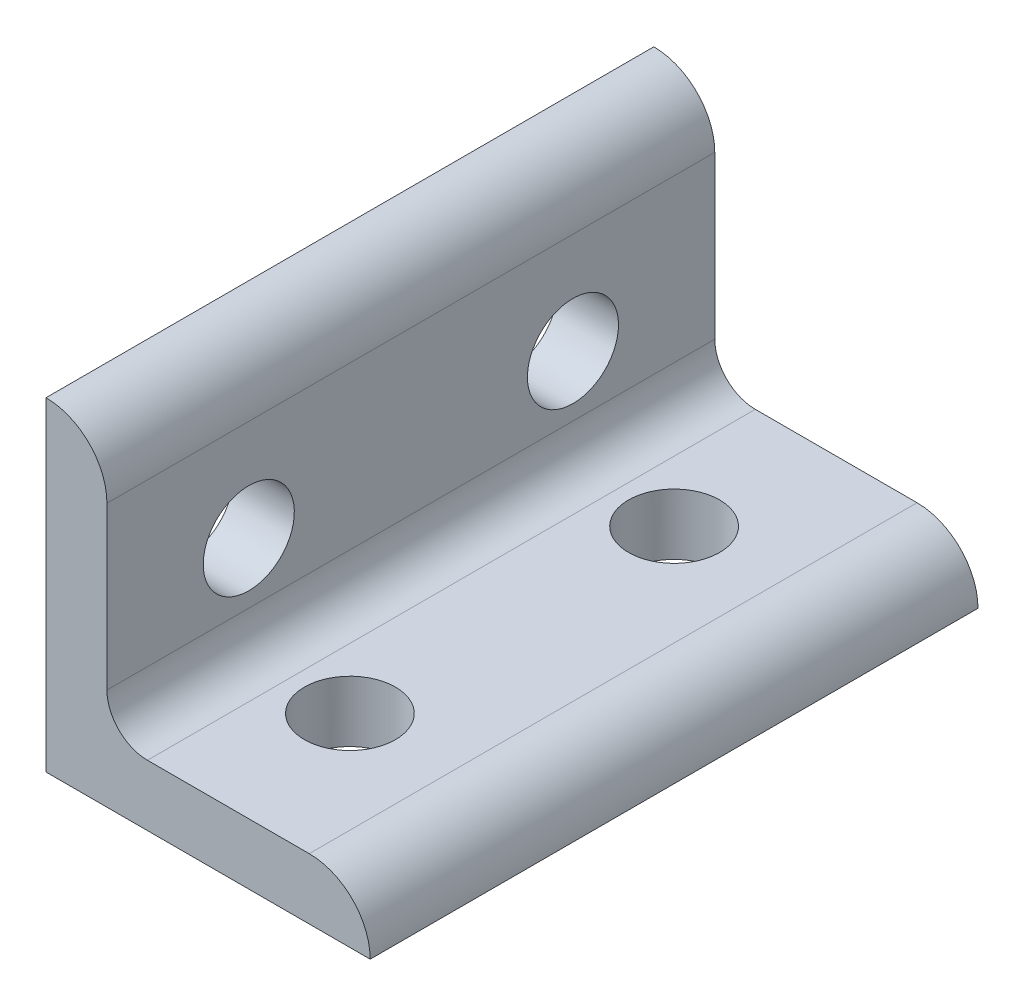
ISO-10303-21;
HEADER;
FILE_DESCRIPTION(('STEP AP214'),'2;1');
FILE_NAME('part.step','',(''),(''),'','','');
FILE_SCHEMA(('AUTOMOTIVE_DESIGN { 1 0 10303 214 1 1 1 1 }'));
ENDSEC;
DATA;
#1=APPLICATION_CONTEXT('core data for automotive mechanical design processes');
#2=APPLICATION_PROTOCOL_DEFINITION('international standard','automotive_design',2000,#1);
#3=PRODUCT_CONTEXT('',#1,'mechanical');
#4=PRODUCT('Part','Part','',(#3));
#5=PRODUCT_RELATED_PRODUCT_CATEGORY('part','',(#4));
#6=PRODUCT_DEFINITION_FORMATION('','',#4);
#7=PRODUCT_DEFINITION_CONTEXT('part definition',#1,'design');
#8=PRODUCT_DEFINITION('design','',#6,#7);
#9=PRODUCT_DEFINITION_SHAPE('','',#8);
#10=(LENGTH_UNIT() NAMED_UNIT(*) SI_UNIT(.MILLI.,.METRE.));
#11=(NAMED_UNIT(*) PLANE_ANGLE_UNIT() SI_UNIT($,.RADIAN.));
#12=(NAMED_UNIT(*) SI_UNIT($,.STERADIAN.) SOLID_ANGLE_UNIT());
#13=UNCERTAINTY_MEASURE_WITH_UNIT(LENGTH_MEASURE(1.E-05),#10,'distance_accuracy_value','');
#14=(GEOMETRIC_REPRESENTATION_CONTEXT(3) GLOBAL_UNCERTAINTY_ASSIGNED_CONTEXT((#13)) GLOBAL_UNIT_ASSIGNED_CONTEXT((#10,
#11,#12)) REPRESENTATION_CONTEXT('',''));
#15=CARTESIAN_POINT('',(0.,0.,0.));
#16=DIRECTION('',(0.,0.,1.));
#17=DIRECTION('',(1.,0.,0.));
#18=AXIS2_PLACEMENT_3D('',#15,#16,#17);
#19=CARTESIAN_POINT('',(4.7752,20.6248,23.8125));
#20=DIRECTION('',(-1.,0.,0.));
#21=DIRECTION('',(0.,-1.,0.));
#22=AXIS2_PLACEMENT_3D('',#19,#20,#21);
#23=PLANE('',#22);
#24=CARTESIAN_POINT('',(4.7752,12.7,12.7));
#25=DIRECTION('',(-1.,0.,0.));
#26=DIRECTION('',(0.,-1.,0.));
#27=AXIS2_PLACEMENT_3D('',#24,#25,#26);
#28=CIRCLE('',#27,3.5687);
#29=CARTESIAN_POINT('',(4.7752,9.1313,12.7));
#30=VERTEX_POINT('',#29);
#31=EDGE_CURVE('E196',#30,#30,#28,.F.);
#32=ORIENTED_EDGE('',*,*,#31,.F.);
#33=EDGE_LOOP('',(#32));
#34=FACE_BOUND('',#33,.T.);
#35=DIRECTION('',(0.,1.,0.));
#36=VECTOR('',#35,1.);
#37=CARTESIAN_POINT('',(4.7752,20.6248,-23.8125));
#38=LINE('',#37,#36);
#39=CARTESIAN_POINT('',(4.7752,7.9502,-23.8125));
#40=VERTEX_POINT('',#39);
#41=CARTESIAN_POINT('',(4.7752,20.6248,-23.8125));
#42=VERTEX_POINT('',#41);
#43=EDGE_CURVE('E117',#40,#42,#38,.T.);
#44=ORIENTED_EDGE('',*,*,#43,.T.);
#45=DIRECTION('',(0.,0.,-1.));
#46=VECTOR('',#45,1.);
#47=CARTESIAN_POINT('',(4.7752,20.6248,23.8125));
#48=LINE('',#47,#46);
#49=CARTESIAN_POINT('',(4.7752,20.6248,23.8125));
#50=VERTEX_POINT('',#49);
#51=EDGE_CURVE('E114',#50,#42,#48,.T.);
#52=ORIENTED_EDGE('',*,*,#51,.F.);
#53=DIRECTION('',(0.,1.,0.));
#54=VECTOR('',#53,1.);
#55=CARTESIAN_POINT('',(4.7752,20.6248,23.8125));
#56=LINE('',#55,#54);
#57=CARTESIAN_POINT('',(4.7752,7.9502,23.8125));
#58=VERTEX_POINT('',#57);
#59=EDGE_CURVE('E103',#58,#50,#56,.T.);
#60=ORIENTED_EDGE('',*,*,#59,.F.);
#61=DIRECTION('',(0.,0.,-1.));
#62=VECTOR('',#61,1.);
#63=CARTESIAN_POINT('',(4.7752,7.9502,23.8125));
#64=LINE('',#63,#62);
#65=EDGE_CURVE('E118',#58,#40,#64,.T.);
#66=ORIENTED_EDGE('',*,*,#65,.T.);
#67=EDGE_LOOP('',(#44,#52,#60,#66));
#68=FACE_BOUND('',#67,.T.);
#69=CARTESIAN_POINT('',(4.7752,12.7,-12.7));
#70=DIRECTION('',(-1.,0.,0.));
#71=DIRECTION('',(0.,-1.,0.));
#72=AXIS2_PLACEMENT_3D('',#69,#70,#71);
#73=CIRCLE('',#72,3.5687);
#74=CARTESIAN_POINT('',(4.7752,9.1313,-12.7));
#75=VERTEX_POINT('',#74);
#76=EDGE_CURVE('E189',#75,#75,#73,.F.);
#77=ORIENTED_EDGE('',*,*,#76,.F.);
#78=EDGE_LOOP('',(#77));
#79=FACE_BOUND('',#78,.T.);
#80=ADVANCED_FACE('F34',(#34,#68,#79),#23,.F.);
#81=CARTESIAN_POINT('',(0.,0.,23.8125));
#82=DIRECTION('',(1.,0.,0.));
#83=DIRECTION('',(0.,0.,-1.));
#84=AXIS2_PLACEMENT_3D('',#81,#82,#83);
#85=PLANE('',#84);
#86=CARTESIAN_POINT('',(0.,12.7,12.7));
#87=DIRECTION('',(1.,0.,0.));
#88=DIRECTION('',(0.,0.,-1.));
#89=AXIS2_PLACEMENT_3D('',#86,#87,#88);
#90=CIRCLE('',#89,3.5687);
#91=CARTESIAN_POINT('',(0.,12.7,9.1313));
#92=VERTEX_POINT('',#91);
#93=EDGE_CURVE('E192',#92,#92,#90,.T.);
#94=ORIENTED_EDGE('',*,*,#93,.T.);
#95=EDGE_LOOP('',(#94));
#96=FACE_BOUND('',#95,.T.);
#97=DIRECTION('',(0.,-1.,0.));
#98=VECTOR('',#97,1.);
#99=CARTESIAN_POINT('',(0.,0.,-23.8125));
#100=LINE('',#99,#98);
#101=CARTESIAN_POINT('',(0.,25.4,-23.8125));
#102=VERTEX_POINT('',#101);
#103=CARTESIAN_POINT('',(0.,0.,-23.8125));
#104=VERTEX_POINT('',#103);
#105=EDGE_CURVE('E85',#102,#104,#100,.T.);
#106=ORIENTED_EDGE('',*,*,#105,.T.);
#107=DIRECTION('',(0.,0.,-1.));
#108=VECTOR('',#107,1.);
#109=CARTESIAN_POINT('',(0.,0.,23.8125));
#110=LINE('',#109,#108);
#111=CARTESIAN_POINT('',(0.,0.,23.8125));
#112=VERTEX_POINT('',#111);
#113=EDGE_CURVE('E123',#112,#104,#110,.T.);
#114=ORIENTED_EDGE('',*,*,#113,.F.);
#115=DIRECTION('',(0.,-1.,0.));
#116=VECTOR('',#115,1.);
#117=CARTESIAN_POINT('',(0.,0.,23.8125));
#118=LINE('',#117,#116);
#119=CARTESIAN_POINT('',(0.,25.4,23.8125));
#120=VERTEX_POINT('',#119);
#121=EDGE_CURVE('E53',#120,#112,#118,.T.);
#122=ORIENTED_EDGE('',*,*,#121,.F.);
#123=DIRECTION('',(0.,0.,-1.));
#124=VECTOR('',#123,1.);
#125=CARTESIAN_POINT('',(0.,25.4,23.8125));
#126=LINE('',#125,#124);
#127=EDGE_CURVE('E119',#120,#102,#126,.T.);
#128=ORIENTED_EDGE('',*,*,#127,.T.);
#129=EDGE_LOOP('',(#106,#114,#122,#128));
#130=FACE_BOUND('',#129,.T.);
#131=CARTESIAN_POINT('',(0.,12.7,-12.7));
#132=DIRECTION('',(1.,0.,0.));
#133=DIRECTION('',(0.,0.,-1.));
#134=AXIS2_PLACEMENT_3D('',#131,#132,#133);
#135=CIRCLE('',#134,3.5687);
#136=CARTESIAN_POINT('',(0.,12.7,-16.2687));
#137=VERTEX_POINT('',#136);
#138=EDGE_CURVE('E187',#137,#137,#135,.T.);
#139=ORIENTED_EDGE('',*,*,#138,.T.);
#140=EDGE_LOOP('',(#139));
#141=FACE_BOUND('',#140,.T.);
#142=ADVANCED_FACE('F180',(#96,#130,#141),#85,.F.);
#143=CARTESIAN_POINT('',(25.4,0.,23.8125));
#144=DIRECTION('',(0.,1.,0.));
#145=DIRECTION('',(-1.,0.,0.));
#146=AXIS2_PLACEMENT_3D('',#143,#144,#145);
#147=PLANE('',#146);
#148=CARTESIAN_POINT('',(12.7,0.,12.7));
#149=DIRECTION('',(0.,1.,0.));
#150=DIRECTION('',(0.,0.,1.));
#151=AXIS2_PLACEMENT_3D('',#148,#149,#150);
#152=CIRCLE('',#151,3.56869999999999);
#153=CARTESIAN_POINT('',(12.7,0.,16.2687));
#154=VERTEX_POINT('',#153);
#155=EDGE_CURVE('E149',#154,#154,#152,.T.);
#156=ORIENTED_EDGE('',*,*,#155,.T.);
#157=EDGE_LOOP('',(#156));
#158=FACE_BOUND('',#157,.T.);
#159=DIRECTION('',(1.,0.,0.));
#160=VECTOR('',#159,1.);
#161=CARTESIAN_POINT('',(25.4,0.,-23.8125));
#162=LINE('',#161,#160);
#163=CARTESIAN_POINT('',(25.4,0.,-23.8125));
#164=VERTEX_POINT('',#163);
#165=EDGE_CURVE('E127',#104,#164,#162,.T.);
#166=ORIENTED_EDGE('',*,*,#165,.T.);
#167=DIRECTION('',(0.,0.,-1.));
#168=VECTOR('',#167,1.);
#169=CARTESIAN_POINT('',(25.4,0.,23.8125));
#170=LINE('',#169,#168);
#171=CARTESIAN_POINT('',(25.4,0.,23.8125));
#172=VERTEX_POINT('',#171);
#173=EDGE_CURVE('E11',#172,#164,#170,.T.);
#174=ORIENTED_EDGE('',*,*,#173,.F.);
#175=DIRECTION('',(1.,0.,0.));
#176=VECTOR('',#175,1.);
#177=CARTESIAN_POINT('',(25.4,0.,23.8125));
#178=LINE('',#177,#176);
#179=EDGE_CURVE('E140',#112,#172,#178,.T.);
#180=ORIENTED_EDGE('',*,*,#179,.F.);
#181=ORIENTED_EDGE('',*,*,#113,.T.);
#182=EDGE_LOOP('',(#166,#174,#180,#181));
#183=FACE_BOUND('',#182,.T.);
#184=CARTESIAN_POINT('',(12.7,0.,-12.7));
#185=DIRECTION('',(0.,1.,0.));
#186=DIRECTION('',(0.,0.,1.));
#187=AXIS2_PLACEMENT_3D('',#184,#185,#186);
#188=CIRCLE('',#187,3.5687);
#189=CARTESIAN_POINT('',(12.7,0.,-9.1313));
#190=VERTEX_POINT('',#189);
#191=EDGE_CURVE('E157',#190,#190,#188,.T.);
#192=ORIENTED_EDGE('',*,*,#191,.T.);
#193=EDGE_LOOP('',(#192));
#194=FACE_BOUND('',#193,.T.);
#195=ADVANCED_FACE('F36',(#158,#183,#194),#147,.F.);
#196=CARTESIAN_POINT('',(7.9502,4.7752,23.8125));
#197=DIRECTION('',(0.,-1.,0.));
#198=DIRECTION('',(0.,0.,-1.));
#199=AXIS2_PLACEMENT_3D('',#196,#197,#198);
#200=PLANE('',#199);
#201=CARTESIAN_POINT('',(12.7,4.7752,12.7));
#202=DIRECTION('',(0.,-1.,0.));
#203=DIRECTION('',(0.,0.,-1.));
#204=AXIS2_PLACEMENT_3D('',#201,#202,#203);
#205=CIRCLE('',#204,3.56869999999999);
#206=CARTESIAN_POINT('',(12.7,4.7752,9.13130000000001));
#207=VERTEX_POINT('',#206);
#208=EDGE_CURVE('E131',#207,#207,#205,.F.);
#209=ORIENTED_EDGE('',*,*,#208,.F.);
#210=EDGE_LOOP('',(#209));
#211=FACE_BOUND('',#210,.T.);
#212=DIRECTION('',(-1.,0.,0.));
#213=VECTOR('',#212,1.);
#214=CARTESIAN_POINT('',(7.9502,4.7752,-23.8125));
#215=LINE('',#214,#213);
#216=CARTESIAN_POINT('',(20.6248,4.7752,-23.8125));
#217=VERTEX_POINT('',#216);
#218=CARTESIAN_POINT('',(7.9502,4.7752,-23.8125));
#219=VERTEX_POINT('',#218);
#220=EDGE_CURVE('E133',#217,#219,#215,.T.);
#221=ORIENTED_EDGE('',*,*,#220,.T.);
#222=DIRECTION('',(0.,0.,-1.));
#223=VECTOR('',#222,1.);
#224=CARTESIAN_POINT('',(7.9502,4.7752,23.8125));
#225=LINE('',#224,#223);
#226=CARTESIAN_POINT('',(7.9502,4.7752,23.8125));
#227=VERTEX_POINT('',#226);
#228=EDGE_CURVE('E144',#227,#219,#225,.T.);
#229=ORIENTED_EDGE('',*,*,#228,.F.);
#230=DIRECTION('',(-1.,0.,0.));
#231=VECTOR('',#230,1.);
#232=CARTESIAN_POINT('',(7.9502,4.7752,23.8125));
#233=LINE('',#232,#231);
#234=CARTESIAN_POINT('',(20.6248,4.7752,23.8125));
#235=VERTEX_POINT('',#234);
#236=EDGE_CURVE('E163',#235,#227,#233,.T.);
#237=ORIENTED_EDGE('',*,*,#236,.F.);
#238=DIRECTION('',(0.,0.,-1.));
#239=VECTOR('',#238,1.);
#240=CARTESIAN_POINT('',(20.6248,4.7752,23.8125));
#241=LINE('',#240,#239);
#242=EDGE_CURVE('E44',#235,#217,#241,.T.);
#243=ORIENTED_EDGE('',*,*,#242,.T.);
#244=EDGE_LOOP('',(#221,#229,#237,#243));
#245=FACE_BOUND('',#244,.T.);
#246=CARTESIAN_POINT('',(12.7,4.7752,-12.7));
#247=DIRECTION('',(0.,-1.,0.));
#248=DIRECTION('',(0.,0.,-1.));
#249=AXIS2_PLACEMENT_3D('',#246,#247,#248);
#250=CIRCLE('',#249,3.5687);
#251=CARTESIAN_POINT('',(12.7,4.7752,-16.2687));
#252=VERTEX_POINT('',#251);
#253=EDGE_CURVE('E38',#252,#252,#250,.F.);
#254=ORIENTED_EDGE('',*,*,#253,.F.);
#255=EDGE_LOOP('',(#254));
#256=FACE_BOUND('',#255,.T.);
#257=ADVANCED_FACE('F167',(#211,#245,#256),#200,.F.);
#258=CARTESIAN_POINT('',(20.6248,0.,23.8125));
#259=DIRECTION('',(0.,0.,-1.));
#260=DIRECTION('',(-1.,0.,0.));
#261=AXIS2_PLACEMENT_3D('',#258,#259,#260);
#262=CYLINDRICAL_SURFACE('',#261,4.7752);
#263=CARTESIAN_POINT('',(20.6248,0.,-23.8125));
#264=DIRECTION('',(0.,0.,1.));
#265=DIRECTION('',(1.,0.,0.));
#266=AXIS2_PLACEMENT_3D('',#263,#264,#265);
#267=CIRCLE('',#266,4.7752);
#268=EDGE_CURVE('E130',#164,#217,#267,.T.);
#269=ORIENTED_EDGE('',*,*,#268,.T.);
#270=ORIENTED_EDGE('',*,*,#242,.F.);
#271=CARTESIAN_POINT('',(20.6248,0.,23.8125));
#272=DIRECTION('',(0.,0.,1.));
#273=DIRECTION('',(1.,0.,0.));
#274=AXIS2_PLACEMENT_3D('',#271,#272,#273);
#275=CIRCLE('',#274,4.7752);
#276=EDGE_CURVE('E93',#172,#235,#275,.T.);
#277=ORIENTED_EDGE('',*,*,#276,.F.);
#278=ORIENTED_EDGE('',*,*,#173,.T.);
#279=EDGE_LOOP('',(#269,#270,#277,#278));
#280=FACE_BOUND('',#279,.T.);
#281=ADVANCED_FACE('F211',(#280),#262,.T.);
#282=CARTESIAN_POINT('',(7.9502,7.9502,23.8125));
#283=DIRECTION('',(0.,0.,-1.));
#284=DIRECTION('',(-1.,0.,0.));
#285=AXIS2_PLACEMENT_3D('',#282,#283,#284);
#286=CYLINDRICAL_SURFACE('',#285,3.175);
#287=CARTESIAN_POINT('',(7.9502,7.9502,-23.8125));
#288=DIRECTION('',(0.,0.,-1.));
#289=DIRECTION('',(1.,0.,0.));
#290=AXIS2_PLACEMENT_3D('',#287,#288,#289);
#291=CIRCLE('',#290,3.175);
#292=EDGE_CURVE('E135',#219,#40,#291,.T.);
#293=ORIENTED_EDGE('',*,*,#292,.T.);
#294=ORIENTED_EDGE('',*,*,#65,.F.);
#295=CARTESIAN_POINT('',(7.9502,7.9502,23.8125));
#296=DIRECTION('',(0.,0.,-1.));
#297=DIRECTION('',(1.,0.,0.));
#298=AXIS2_PLACEMENT_3D('',#295,#296,#297);
#299=CIRCLE('',#298,3.175);
#300=EDGE_CURVE('E109',#227,#58,#299,.T.);
#301=ORIENTED_EDGE('',*,*,#300,.F.);
#302=ORIENTED_EDGE('',*,*,#228,.T.);
#303=EDGE_LOOP('',(#293,#294,#301,#302));
#304=FACE_BOUND('',#303,.T.);
#305=ADVANCED_FACE('F172',(#304),#286,.F.);
#306=CARTESIAN_POINT('',(0.,20.6248,23.8125));
#307=DIRECTION('',(0.,0.,-1.));
#308=DIRECTION('',(-1.,0.,0.));
#309=AXIS2_PLACEMENT_3D('',#306,#307,#308);
#310=CYLINDRICAL_SURFACE('',#309,4.7752);
#311=CARTESIAN_POINT('',(0.,20.6248,-23.8125));
#312=DIRECTION('',(0.,0.,1.));
#313=DIRECTION('',(1.,0.,0.));
#314=AXIS2_PLACEMENT_3D('',#311,#312,#313);
#315=CIRCLE('',#314,4.7752);
#316=EDGE_CURVE('E79',#42,#102,#315,.T.);
#317=ORIENTED_EDGE('',*,*,#316,.T.);
#318=ORIENTED_EDGE('',*,*,#127,.F.);
#319=CARTESIAN_POINT('',(0.,20.6248,23.8125));
#320=DIRECTION('',(0.,0.,1.));
#321=DIRECTION('',(1.,0.,0.));
#322=AXIS2_PLACEMENT_3D('',#319,#320,#321);
#323=CIRCLE('',#322,4.7752);
#324=EDGE_CURVE('E107',#50,#120,#323,.T.);
#325=ORIENTED_EDGE('',*,*,#324,.F.);
#326=ORIENTED_EDGE('',*,*,#51,.T.);
#327=EDGE_LOOP('',(#317,#318,#325,#326));
#328=FACE_BOUND('',#327,.T.);
#329=ADVANCED_FACE('F121',(#328),#310,.T.);
#330=CARTESIAN_POINT('',(0.,20.6248,23.8125));
#331=DIRECTION('',(0.,0.,1.));
#332=DIRECTION('',(1.,0.,0.));
#333=AXIS2_PLACEMENT_3D('',#330,#331,#332);
#334=PLANE('',#333);
#335=ORIENTED_EDGE('',*,*,#179,.T.);
#336=ORIENTED_EDGE('',*,*,#276,.T.);
#337=ORIENTED_EDGE('',*,*,#236,.T.);
#338=ORIENTED_EDGE('',*,*,#300,.T.);
#339=ORIENTED_EDGE('',*,*,#59,.T.);
#340=ORIENTED_EDGE('',*,*,#324,.T.);
#341=ORIENTED_EDGE('',*,*,#121,.T.);
#342=EDGE_LOOP('',(#335,#336,#337,#338,#339,#340,#341));
#343=FACE_BOUND('',#342,.T.);
#344=ADVANCED_FACE('F105',(#343),#334,.T.);
#345=CARTESIAN_POINT('',(0.,20.6248,-23.8125));
#346=DIRECTION('',(0.,0.,1.));
#347=DIRECTION('',(1.,0.,0.));
#348=AXIS2_PLACEMENT_3D('',#345,#346,#347);
#349=PLANE('',#348);
#350=ORIENTED_EDGE('',*,*,#165,.F.);
#351=ORIENTED_EDGE('',*,*,#105,.F.);
#352=ORIENTED_EDGE('',*,*,#316,.F.);
#353=ORIENTED_EDGE('',*,*,#43,.F.);
#354=ORIENTED_EDGE('',*,*,#292,.F.);
#355=ORIENTED_EDGE('',*,*,#220,.F.);
#356=ORIENTED_EDGE('',*,*,#268,.F.);
#357=EDGE_LOOP('',(#350,#351,#352,#353,#354,#355,#356));
#358=FACE_BOUND('',#357,.T.);
#359=ADVANCED_FACE('F175',(#358),#349,.F.);
#360=CARTESIAN_POINT('',(12.7,25.4,12.7));
#361=DIRECTION('',(0.,-1.,0.));
#362=DIRECTION('',(0.,0.,-1.));
#363=AXIS2_PLACEMENT_3D('',#360,#361,#362);
#364=CYLINDRICAL_SURFACE('',#363,3.56869999999999);
#365=ORIENTED_EDGE('',*,*,#155,.F.);
#366=EDGE_LOOP('',(#365));
#367=FACE_BOUND('',#366,.T.);
#368=ORIENTED_EDGE('',*,*,#208,.T.);
#369=EDGE_LOOP('',(#368));
#370=FACE_BOUND('',#369,.T.);
#371=ADVANCED_FACE('F207',(#367,#370),#364,.F.);
#372=CARTESIAN_POINT('',(12.7,25.4,-12.7));
#373=DIRECTION('',(0.,-1.,0.));
#374=DIRECTION('',(0.,0.,-1.));
#375=AXIS2_PLACEMENT_3D('',#372,#373,#374);
#376=CYLINDRICAL_SURFACE('',#375,3.5687);
#377=ORIENTED_EDGE('',*,*,#191,.F.);
#378=EDGE_LOOP('',(#377));
#379=FACE_BOUND('',#378,.T.);
#380=ORIENTED_EDGE('',*,*,#253,.T.);
#381=EDGE_LOOP('',(#380));
#382=FACE_BOUND('',#381,.T.);
#383=ADVANCED_FACE('F203',(#379,#382),#376,.F.);
#384=CARTESIAN_POINT('',(25.4,12.7,12.7));
#385=DIRECTION('',(-1.,0.,0.));
#386=DIRECTION('',(0.,0.,1.));
#387=AXIS2_PLACEMENT_3D('',#384,#385,#386);
#388=CYLINDRICAL_SURFACE('',#387,3.5687);
#389=ORIENTED_EDGE('',*,*,#93,.F.);
#390=EDGE_LOOP('',(#389));
#391=FACE_BOUND('',#390,.T.);
#392=ORIENTED_EDGE('',*,*,#31,.T.);
#393=EDGE_LOOP('',(#392));
#394=FACE_BOUND('',#393,.T.);
#395=ADVANCED_FACE('F206',(#391,#394),#388,.F.);
#396=CARTESIAN_POINT('',(25.4,12.7,-12.7));
#397=DIRECTION('',(-1.,0.,0.));
#398=DIRECTION('',(0.,0.,1.));
#399=AXIS2_PLACEMENT_3D('',#396,#397,#398);
#400=CYLINDRICAL_SURFACE('',#399,3.5687);
#401=ORIENTED_EDGE('',*,*,#138,.F.);
#402=EDGE_LOOP('',(#401));
#403=FACE_BOUND('',#402,.T.);
#404=ORIENTED_EDGE('',*,*,#76,.T.);
#405=EDGE_LOOP('',(#404));
#406=FACE_BOUND('',#405,.T.);
#407=ADVANCED_FACE('F243',(#403,#406),#400,.F.);
#408=CLOSED_SHELL('',(#80,#142,#195,#257,#281,#305,#329,#344,#359,#371,#383,#395,#407));
#409=MANIFOLD_SOLID_BREP('B2',#408);
#410=ADVANCED_BREP_SHAPE_REPRESENTATION('',(#18,#409),#14);
#411=SHAPE_DEFINITION_REPRESENTATION(#9,#410);
ENDSEC;
END-ISO-10303-21;
